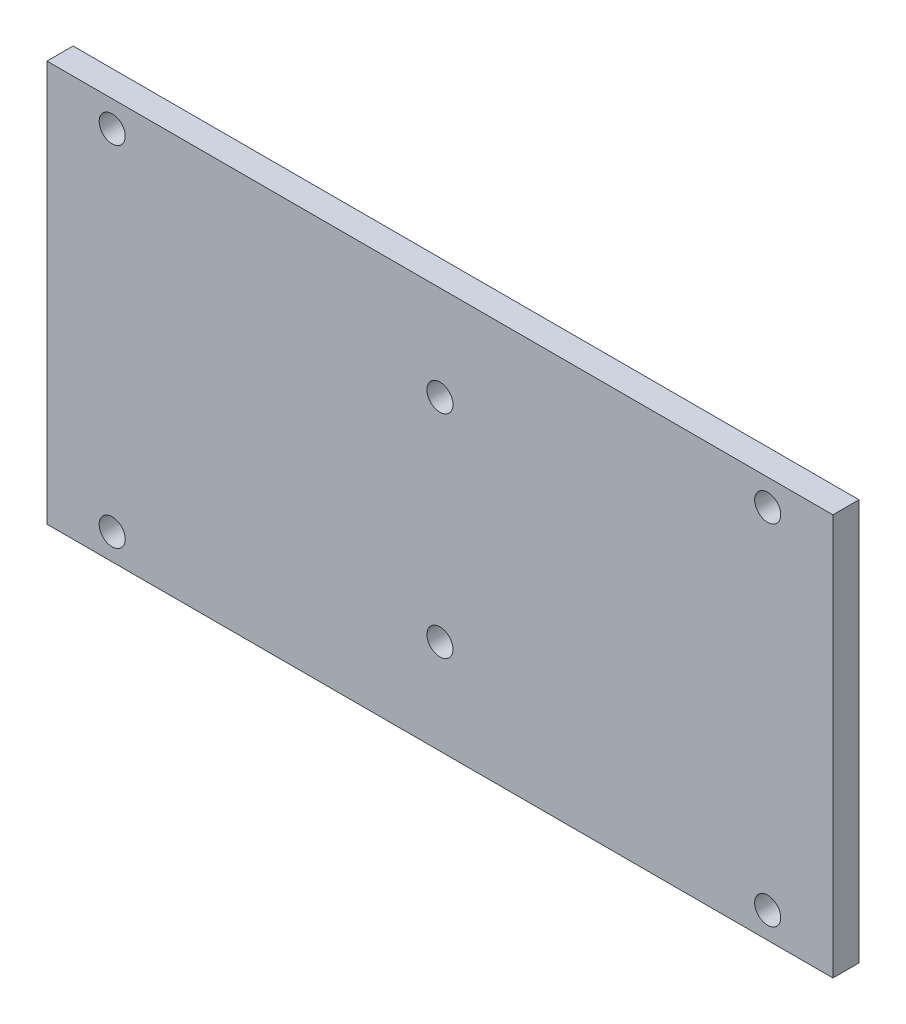
ISO-10303-21;
HEADER;
FILE_DESCRIPTION(('STEP AP214'),'2;1');
FILE_NAME('part.step','',(''),(''),'','','');
FILE_SCHEMA(('AUTOMOTIVE_DESIGN { 1 0 10303 214 1 1 1 1 }'));
ENDSEC;
DATA;
#1=APPLICATION_CONTEXT('core data for automotive mechanical design processes');
#2=APPLICATION_PROTOCOL_DEFINITION('international standard','automotive_design',2000,#1);
#3=PRODUCT_CONTEXT('',#1,'mechanical');
#4=PRODUCT('Part','Part','',(#3));
#5=PRODUCT_RELATED_PRODUCT_CATEGORY('part','',(#4));
#6=PRODUCT_DEFINITION_FORMATION('','',#4);
#7=PRODUCT_DEFINITION_CONTEXT('part definition',#1,'design');
#8=PRODUCT_DEFINITION('design','',#6,#7);
#9=PRODUCT_DEFINITION_SHAPE('','',#8);
#10=(LENGTH_UNIT() NAMED_UNIT(*) SI_UNIT(.MILLI.,.METRE.));
#11=(NAMED_UNIT(*) PLANE_ANGLE_UNIT() SI_UNIT($,.RADIAN.));
#12=(NAMED_UNIT(*) SI_UNIT($,.STERADIAN.) SOLID_ANGLE_UNIT());
#13=UNCERTAINTY_MEASURE_WITH_UNIT(LENGTH_MEASURE(1.E-05),#10,'distance_accuracy_value','');
#14=(GEOMETRIC_REPRESENTATION_CONTEXT(3) GLOBAL_UNCERTAINTY_ASSIGNED_CONTEXT((#13)) GLOBAL_UNIT_ASSIGNED_CONTEXT((#10,
#11,#12)) REPRESENTATION_CONTEXT('',''));
#15=CARTESIAN_POINT('',(0.,0.,0.));
#16=DIRECTION('',(0.,0.,1.));
#17=DIRECTION('',(1.,0.,0.));
#18=AXIS2_PLACEMENT_3D('',#15,#16,#17);
#19=CARTESIAN_POINT('',(0.,0.,4.));
#20=DIRECTION('',(0.,0.,1.));
#21=DIRECTION('',(1.,0.,0.));
#22=AXIS2_PLACEMENT_3D('',#19,#20,#21);
#23=PLANE('',#22);
#24=CARTESIAN_POINT('',(0.,16.25,4.));
#25=DIRECTION('',(0.,0.,1.));
#26=DIRECTION('',(1.,0.,0.));
#27=AXIS2_PLACEMENT_3D('',#24,#25,#26);
#28=CIRCLE('',#27,2.);
#29=CARTESIAN_POINT('',(2.,16.25,4.));
#30=VERTEX_POINT('',#29);
#31=EDGE_CURVE('E133',#30,#30,#28,.T.);
#32=ORIENTED_EDGE('',*,*,#31,.F.);
#33=EDGE_LOOP('',(#32));
#34=FACE_BOUND('',#33,.T.);
#35=CARTESIAN_POINT('',(50.25,-26.75,4.));
#36=DIRECTION('',(0.,0.,1.));
#37=DIRECTION('',(-1.,0.,0.));
#38=AXIS2_PLACEMENT_3D('',#35,#36,#37);
#39=CIRCLE('',#38,2.);
#40=CARTESIAN_POINT('',(48.25,-26.75,4.));
#41=VERTEX_POINT('',#40);
#42=EDGE_CURVE('E121',#41,#41,#39,.T.);
#43=ORIENTED_EDGE('',*,*,#42,.F.);
#44=EDGE_LOOP('',(#43));
#45=FACE_BOUND('',#44,.T.);
#46=CARTESIAN_POINT('',(-50.25,26.75,4.));
#47=DIRECTION('',(0.,0.,1.));
#48=DIRECTION('',(1.,0.,0.));
#49=AXIS2_PLACEMENT_3D('',#46,#47,#48);
#50=CIRCLE('',#49,2.);
#51=CARTESIAN_POINT('',(-48.25,26.75,4.));
#52=VERTEX_POINT('',#51);
#53=EDGE_CURVE('E100',#52,#52,#50,.T.);
#54=ORIENTED_EDGE('',*,*,#53,.F.);
#55=EDGE_LOOP('',(#54));
#56=FACE_BOUND('',#55,.T.);
#57=DIRECTION('',(0.,-1.,0.));
#58=VECTOR('',#57,1.);
#59=CARTESIAN_POINT('',(-60.25,-30.75,4.));
#60=LINE('',#59,#58);
#61=CARTESIAN_POINT('',(-60.25,30.75,4.));
#62=VERTEX_POINT('',#61);
#63=CARTESIAN_POINT('',(-60.25,-30.75,4.));
#64=VERTEX_POINT('',#63);
#65=EDGE_CURVE('E85',#62,#64,#60,.T.);
#66=ORIENTED_EDGE('',*,*,#65,.T.);
#67=DIRECTION('',(1.,0.,0.));
#68=VECTOR('',#67,1.);
#69=CARTESIAN_POINT('',(60.25,-30.75,4.));
#70=LINE('',#69,#68);
#71=CARTESIAN_POINT('',(60.25,-30.75,4.));
#72=VERTEX_POINT('',#71);
#73=EDGE_CURVE('E80',#64,#72,#70,.T.);
#74=ORIENTED_EDGE('',*,*,#73,.T.);
#75=DIRECTION('',(0.,1.,0.));
#76=VECTOR('',#75,1.);
#77=CARTESIAN_POINT('',(60.25,-30.75,4.));
#78=LINE('',#77,#76);
#79=CARTESIAN_POINT('',(60.25,30.75,4.));
#80=VERTEX_POINT('',#79);
#81=EDGE_CURVE('E83',#72,#80,#78,.T.);
#82=ORIENTED_EDGE('',*,*,#81,.T.);
#83=DIRECTION('',(-1.,0.,0.));
#84=VECTOR('',#83,1.);
#85=CARTESIAN_POINT('',(60.25,30.75,4.));
#86=LINE('',#85,#84);
#87=EDGE_CURVE('E50',#80,#62,#86,.T.);
#88=ORIENTED_EDGE('',*,*,#87,.T.);
#89=EDGE_LOOP('',(#66,#74,#82,#88));
#90=FACE_BOUND('',#89,.T.);
#91=CARTESIAN_POINT('',(-50.25,-26.75,4.));
#92=DIRECTION('',(0.,0.,1.));
#93=DIRECTION('',(1.,0.,0.));
#94=AXIS2_PLACEMENT_3D('',#91,#92,#93);
#95=CIRCLE('',#94,2.);
#96=CARTESIAN_POINT('',(-48.25,-26.75,4.));
#97=VERTEX_POINT('',#96);
#98=EDGE_CURVE('E115',#97,#97,#95,.T.);
#99=ORIENTED_EDGE('',*,*,#98,.F.);
#100=EDGE_LOOP('',(#99));
#101=FACE_BOUND('',#100,.T.);
#102=CARTESIAN_POINT('',(50.25,26.75,4.));
#103=DIRECTION('',(0.,0.,1.));
#104=DIRECTION('',(-1.,0.,0.));
#105=AXIS2_PLACEMENT_3D('',#102,#103,#104);
#106=CIRCLE('',#105,2.);
#107=CARTESIAN_POINT('',(48.25,26.75,4.));
#108=VERTEX_POINT('',#107);
#109=EDGE_CURVE('E127',#108,#108,#106,.T.);
#110=ORIENTED_EDGE('',*,*,#109,.F.);
#111=EDGE_LOOP('',(#110));
#112=FACE_BOUND('',#111,.T.);
#113=CARTESIAN_POINT('',(0.,-16.25,4.));
#114=DIRECTION('',(0.,0.,1.));
#115=DIRECTION('',(1.,0.,0.));
#116=AXIS2_PLACEMENT_3D('',#113,#114,#115);
#117=CIRCLE('',#116,2.);
#118=CARTESIAN_POINT('',(2.00000000000001,-16.25,4.));
#119=VERTEX_POINT('',#118);
#120=EDGE_CURVE('E139',#119,#119,#117,.T.);
#121=ORIENTED_EDGE('',*,*,#120,.F.);
#122=EDGE_LOOP('',(#121));
#123=FACE_BOUND('',#122,.T.);
#124=ADVANCED_FACE('F33',(#34,#45,#56,#90,#101,#112,#123),#23,.T.);
#125=CARTESIAN_POINT('',(0.,0.,0.));
#126=DIRECTION('',(0.,0.,1.));
#127=DIRECTION('',(1.,0.,0.));
#128=AXIS2_PLACEMENT_3D('',#125,#126,#127);
#129=PLANE('',#128);
#130=DIRECTION('',(0.,-1.,0.));
#131=VECTOR('',#130,1.);
#132=CARTESIAN_POINT('',(-60.25,-30.75,0.));
#133=LINE('',#132,#131);
#134=CARTESIAN_POINT('',(-60.25,30.75,0.));
#135=VERTEX_POINT('',#134);
#136=CARTESIAN_POINT('',(-60.25,-30.75,0.));
#137=VERTEX_POINT('',#136);
#138=EDGE_CURVE('E97',#135,#137,#133,.T.);
#139=ORIENTED_EDGE('',*,*,#138,.F.);
#140=DIRECTION('',(-1.,0.,0.));
#141=VECTOR('',#140,1.);
#142=CARTESIAN_POINT('',(60.25,30.75,0.));
#143=LINE('',#142,#141);
#144=CARTESIAN_POINT('',(60.25,30.75,0.));
#145=VERTEX_POINT('',#144);
#146=EDGE_CURVE('E73',#145,#135,#143,.T.);
#147=ORIENTED_EDGE('',*,*,#146,.F.);
#148=DIRECTION('',(0.,1.,0.));
#149=VECTOR('',#148,1.);
#150=CARTESIAN_POINT('',(60.25,-30.75,0.));
#151=LINE('',#150,#149);
#152=CARTESIAN_POINT('',(60.25,-30.75,0.));
#153=VERTEX_POINT('',#152);
#154=EDGE_CURVE('E67',#153,#145,#151,.T.);
#155=ORIENTED_EDGE('',*,*,#154,.F.);
#156=DIRECTION('',(1.,0.,0.));
#157=VECTOR('',#156,1.);
#158=CARTESIAN_POINT('',(60.25,-30.75,0.));
#159=LINE('',#158,#157);
#160=EDGE_CURVE('E89',#137,#153,#159,.T.);
#161=ORIENTED_EDGE('',*,*,#160,.F.);
#162=EDGE_LOOP('',(#139,#147,#155,#161));
#163=FACE_BOUND('',#162,.T.);
#164=CARTESIAN_POINT('',(-50.25,26.75,0.));
#165=DIRECTION('',(0.,0.,1.));
#166=DIRECTION('',(1.,0.,0.));
#167=AXIS2_PLACEMENT_3D('',#164,#165,#166);
#168=CIRCLE('',#167,2.);
#169=CARTESIAN_POINT('',(-48.25,26.75,0.));
#170=VERTEX_POINT('',#169);
#171=EDGE_CURVE('E112',#170,#170,#168,.T.);
#172=ORIENTED_EDGE('',*,*,#171,.T.);
#173=EDGE_LOOP('',(#172));
#174=FACE_BOUND('',#173,.T.);
#175=CARTESIAN_POINT('',(-50.25,-26.75,0.));
#176=DIRECTION('',(0.,0.,1.));
#177=DIRECTION('',(1.,0.,0.));
#178=AXIS2_PLACEMENT_3D('',#175,#176,#177);
#179=CIRCLE('',#178,2.);
#180=CARTESIAN_POINT('',(-48.25,-26.75,0.));
#181=VERTEX_POINT('',#180);
#182=EDGE_CURVE('E118',#181,#181,#179,.T.);
#183=ORIENTED_EDGE('',*,*,#182,.T.);
#184=EDGE_LOOP('',(#183));
#185=FACE_BOUND('',#184,.T.);
#186=CARTESIAN_POINT('',(50.25,-26.75,0.));
#187=DIRECTION('',(0.,0.,1.));
#188=DIRECTION('',(-1.,0.,0.));
#189=AXIS2_PLACEMENT_3D('',#186,#187,#188);
#190=CIRCLE('',#189,2.);
#191=CARTESIAN_POINT('',(48.25,-26.75,0.));
#192=VERTEX_POINT('',#191);
#193=EDGE_CURVE('E124',#192,#192,#190,.T.);
#194=ORIENTED_EDGE('',*,*,#193,.T.);
#195=EDGE_LOOP('',(#194));
#196=FACE_BOUND('',#195,.T.);
#197=CARTESIAN_POINT('',(50.25,26.75,0.));
#198=DIRECTION('',(0.,0.,1.));
#199=DIRECTION('',(-1.,0.,0.));
#200=AXIS2_PLACEMENT_3D('',#197,#198,#199);
#201=CIRCLE('',#200,2.);
#202=CARTESIAN_POINT('',(48.25,26.75,0.));
#203=VERTEX_POINT('',#202);
#204=EDGE_CURVE('E130',#203,#203,#201,.T.);
#205=ORIENTED_EDGE('',*,*,#204,.T.);
#206=EDGE_LOOP('',(#205));
#207=FACE_BOUND('',#206,.T.);
#208=CARTESIAN_POINT('',(0.,16.25,0.));
#209=DIRECTION('',(0.,0.,1.));
#210=DIRECTION('',(1.,0.,0.));
#211=AXIS2_PLACEMENT_3D('',#208,#209,#210);
#212=CIRCLE('',#211,2.);
#213=CARTESIAN_POINT('',(2.,16.25,0.));
#214=VERTEX_POINT('',#213);
#215=EDGE_CURVE('E136',#214,#214,#212,.T.);
#216=ORIENTED_EDGE('',*,*,#215,.T.);
#217=EDGE_LOOP('',(#216));
#218=FACE_BOUND('',#217,.T.);
#219=CARTESIAN_POINT('',(0.,-16.25,0.));
#220=DIRECTION('',(0.,0.,1.));
#221=DIRECTION('',(1.,0.,0.));
#222=AXIS2_PLACEMENT_3D('',#219,#220,#221);
#223=CIRCLE('',#222,2.);
#224=CARTESIAN_POINT('',(2.00000000000001,-16.25,0.));
#225=VERTEX_POINT('',#224);
#226=EDGE_CURVE('E142',#225,#225,#223,.T.);
#227=ORIENTED_EDGE('',*,*,#226,.T.);
#228=EDGE_LOOP('',(#227));
#229=FACE_BOUND('',#228,.T.);
#230=ADVANCED_FACE('F108',(#163,#174,#185,#196,#207,#218,#229),#129,.F.);
#231=CARTESIAN_POINT('',(-60.25,-30.75,4.));
#232=DIRECTION('',(1.,0.,0.));
#233=DIRECTION('',(0.,0.,-1.));
#234=AXIS2_PLACEMENT_3D('',#231,#232,#233);
#235=PLANE('',#234);
#236=ORIENTED_EDGE('',*,*,#138,.T.);
#237=DIRECTION('',(0.,0.,-1.));
#238=VECTOR('',#237,1.);
#239=CARTESIAN_POINT('',(-60.25,-30.75,4.));
#240=LINE('',#239,#238);
#241=EDGE_CURVE('E11',#64,#137,#240,.T.);
#242=ORIENTED_EDGE('',*,*,#241,.F.);
#243=ORIENTED_EDGE('',*,*,#65,.F.);
#244=DIRECTION('',(0.,0.,-1.));
#245=VECTOR('',#244,1.);
#246=CARTESIAN_POINT('',(-60.25,30.75,4.));
#247=LINE('',#246,#245);
#248=EDGE_CURVE('E93',#62,#135,#247,.T.);
#249=ORIENTED_EDGE('',*,*,#248,.T.);
#250=EDGE_LOOP('',(#236,#242,#243,#249));
#251=FACE_BOUND('',#250,.T.);
#252=ADVANCED_FACE('F35',(#251),#235,.F.);
#253=CARTESIAN_POINT('',(60.25,-30.75,4.));
#254=DIRECTION('',(0.,1.,0.));
#255=DIRECTION('',(-1.,0.,0.));
#256=AXIS2_PLACEMENT_3D('',#253,#254,#255);
#257=PLANE('',#256);
#258=ORIENTED_EDGE('',*,*,#160,.T.);
#259=DIRECTION('',(0.,0.,-1.));
#260=VECTOR('',#259,1.);
#261=CARTESIAN_POINT('',(60.25,-30.75,4.));
#262=LINE('',#261,#260);
#263=EDGE_CURVE('E42',#72,#153,#262,.T.);
#264=ORIENTED_EDGE('',*,*,#263,.F.);
#265=ORIENTED_EDGE('',*,*,#73,.F.);
#266=ORIENTED_EDGE('',*,*,#241,.T.);
#267=EDGE_LOOP('',(#258,#264,#265,#266));
#268=FACE_BOUND('',#267,.T.);
#269=ADVANCED_FACE('F88',(#268),#257,.F.);
#270=CARTESIAN_POINT('',(60.25,-30.75,4.));
#271=DIRECTION('',(-1.,0.,0.));
#272=DIRECTION('',(0.,0.,1.));
#273=AXIS2_PLACEMENT_3D('',#270,#271,#272);
#274=PLANE('',#273);
#275=ORIENTED_EDGE('',*,*,#154,.T.);
#276=DIRECTION('',(0.,0.,-1.));
#277=VECTOR('',#276,1.);
#278=CARTESIAN_POINT('',(60.25,30.75,4.));
#279=LINE('',#278,#277);
#280=EDGE_CURVE('E90',#80,#145,#279,.T.);
#281=ORIENTED_EDGE('',*,*,#280,.F.);
#282=ORIENTED_EDGE('',*,*,#81,.F.);
#283=ORIENTED_EDGE('',*,*,#263,.T.);
#284=EDGE_LOOP('',(#275,#281,#282,#283));
#285=FACE_BOUND('',#284,.T.);
#286=ADVANCED_FACE('F91',(#285),#274,.F.);
#287=CARTESIAN_POINT('',(60.25,30.75,4.));
#288=DIRECTION('',(0.,-1.,0.));
#289=DIRECTION('',(1.,0.,0.));
#290=AXIS2_PLACEMENT_3D('',#287,#288,#289);
#291=PLANE('',#290);
#292=ORIENTED_EDGE('',*,*,#146,.T.);
#293=ORIENTED_EDGE('',*,*,#248,.F.);
#294=ORIENTED_EDGE('',*,*,#87,.F.);
#295=ORIENTED_EDGE('',*,*,#280,.T.);
#296=EDGE_LOOP('',(#292,#293,#294,#295));
#297=FACE_BOUND('',#296,.T.);
#298=ADVANCED_FACE('F105',(#297),#291,.F.);
#299=CARTESIAN_POINT('',(-50.25,26.75,4.));
#300=DIRECTION('',(0.,0.,-1.));
#301=DIRECTION('',(-1.,0.,0.));
#302=AXIS2_PLACEMENT_3D('',#299,#300,#301);
#303=CYLINDRICAL_SURFACE('',#302,2.);
#304=ORIENTED_EDGE('',*,*,#53,.T.);
#305=EDGE_LOOP('',(#304));
#306=FACE_BOUND('',#305,.T.);
#307=ORIENTED_EDGE('',*,*,#171,.F.);
#308=EDGE_LOOP('',(#307));
#309=FACE_BOUND('',#308,.T.);
#310=ADVANCED_FACE('F161',(#306,#309),#303,.F.);
#311=CARTESIAN_POINT('',(-50.25,-26.75,4.));
#312=DIRECTION('',(0.,0.,-1.));
#313=DIRECTION('',(-1.,0.,0.));
#314=AXIS2_PLACEMENT_3D('',#311,#312,#313);
#315=CYLINDRICAL_SURFACE('',#314,2.);
#316=ORIENTED_EDGE('',*,*,#98,.T.);
#317=EDGE_LOOP('',(#316));
#318=FACE_BOUND('',#317,.T.);
#319=ORIENTED_EDGE('',*,*,#182,.F.);
#320=EDGE_LOOP('',(#319));
#321=FACE_BOUND('',#320,.T.);
#322=ADVANCED_FACE('F207',(#318,#321),#315,.F.);
#323=CARTESIAN_POINT('',(50.25,-26.75,4.));
#324=DIRECTION('',(0.,0.,-1.));
#325=DIRECTION('',(-1.,0.,0.));
#326=AXIS2_PLACEMENT_3D('',#323,#324,#325);
#327=CYLINDRICAL_SURFACE('',#326,2.);
#328=ORIENTED_EDGE('',*,*,#42,.T.);
#329=EDGE_LOOP('',(#328));
#330=FACE_BOUND('',#329,.T.);
#331=ORIENTED_EDGE('',*,*,#193,.F.);
#332=EDGE_LOOP('',(#331));
#333=FACE_BOUND('',#332,.T.);
#334=ADVANCED_FACE('F215',(#330,#333),#327,.F.);
#335=CARTESIAN_POINT('',(50.25,26.75,4.));
#336=DIRECTION('',(0.,0.,-1.));
#337=DIRECTION('',(-1.,0.,0.));
#338=AXIS2_PLACEMENT_3D('',#335,#336,#337);
#339=CYLINDRICAL_SURFACE('',#338,2.);
#340=ORIENTED_EDGE('',*,*,#109,.T.);
#341=EDGE_LOOP('',(#340));
#342=FACE_BOUND('',#341,.T.);
#343=ORIENTED_EDGE('',*,*,#204,.F.);
#344=EDGE_LOOP('',(#343));
#345=FACE_BOUND('',#344,.T.);
#346=ADVANCED_FACE('F223',(#342,#345),#339,.F.);
#347=CARTESIAN_POINT('',(0.,16.25,4.));
#348=DIRECTION('',(0.,0.,-1.));
#349=DIRECTION('',(-1.,0.,0.));
#350=AXIS2_PLACEMENT_3D('',#347,#348,#349);
#351=CYLINDRICAL_SURFACE('',#350,2.);
#352=ORIENTED_EDGE('',*,*,#31,.T.);
#353=EDGE_LOOP('',(#352));
#354=FACE_BOUND('',#353,.T.);
#355=ORIENTED_EDGE('',*,*,#215,.F.);
#356=EDGE_LOOP('',(#355));
#357=FACE_BOUND('',#356,.T.);
#358=ADVANCED_FACE('F232',(#354,#357),#351,.F.);
#359=CARTESIAN_POINT('',(0.,-16.25,4.));
#360=DIRECTION('',(0.,0.,-1.));
#361=DIRECTION('',(-1.,0.,0.));
#362=AXIS2_PLACEMENT_3D('',#359,#360,#361);
#363=CYLINDRICAL_SURFACE('',#362,2.);
#364=ORIENTED_EDGE('',*,*,#120,.T.);
#365=EDGE_LOOP('',(#364));
#366=FACE_BOUND('',#365,.T.);
#367=ORIENTED_EDGE('',*,*,#226,.F.);
#368=EDGE_LOOP('',(#367));
#369=FACE_BOUND('',#368,.T.);
#370=ADVANCED_FACE('F148',(#366,#369),#363,.F.);
#371=CLOSED_SHELL('',(#124,#230,#252,#269,#286,#298,#310,#322,#334,#346,#358,#370));
#372=MANIFOLD_SOLID_BREP('B2',#371);
#373=ADVANCED_BREP_SHAPE_REPRESENTATION('',(#18,#372),#14);
#374=SHAPE_DEFINITION_REPRESENTATION(#9,#373);
ENDSEC;
END-ISO-10303-21;
